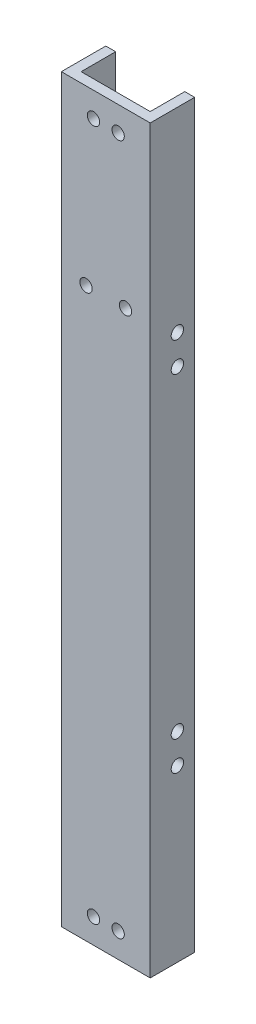
ISO-10303-21;
HEADER;
FILE_DESCRIPTION(('STEP AP214'),'2;1');
FILE_NAME('part.step','',(''),(''),'','','');
FILE_SCHEMA(('AUTOMOTIVE_DESIGN { 1 0 10303 214 1 1 1 1 }'));
ENDSEC;
DATA;
#1=APPLICATION_CONTEXT('core data for automotive mechanical design processes');
#2=APPLICATION_PROTOCOL_DEFINITION('international standard','automotive_design',2000,#1);
#3=PRODUCT_CONTEXT('',#1,'mechanical');
#4=PRODUCT('Part','Part','',(#3));
#5=PRODUCT_RELATED_PRODUCT_CATEGORY('part','',(#4));
#6=PRODUCT_DEFINITION_FORMATION('','',#4);
#7=PRODUCT_DEFINITION_CONTEXT('part definition',#1,'design');
#8=PRODUCT_DEFINITION('design','',#6,#7);
#9=PRODUCT_DEFINITION_SHAPE('','',#8);
#10=(LENGTH_UNIT() NAMED_UNIT(*) SI_UNIT(.MILLI.,.METRE.));
#11=(NAMED_UNIT(*) PLANE_ANGLE_UNIT() SI_UNIT($,.RADIAN.));
#12=(NAMED_UNIT(*) SI_UNIT($,.STERADIAN.) SOLID_ANGLE_UNIT());
#13=UNCERTAINTY_MEASURE_WITH_UNIT(LENGTH_MEASURE(1.E-05),#10,'distance_accuracy_value','');
#14=(GEOMETRIC_REPRESENTATION_CONTEXT(3) GLOBAL_UNCERTAINTY_ASSIGNED_CONTEXT((#13)) GLOBAL_UNIT_ASSIGNED_CONTEXT((#10,
#11,#12)) REPRESENTATION_CONTEXT('',''));
#15=CARTESIAN_POINT('',(0.,0.,0.));
#16=DIRECTION('',(0.,0.,1.));
#17=DIRECTION('',(1.,0.,0.));
#18=AXIS2_PLACEMENT_3D('',#15,#16,#17);
#19=CARTESIAN_POINT('',(9.,150.,-4.5));
#20=DIRECTION('',(-1.,0.,0.));
#21=DIRECTION('',(0.,0.,1.));
#22=AXIS2_PLACEMENT_3D('',#19,#20,#21);
#23=PLANE('',#22);
#24=CARTESIAN_POINT('',(9.,110.5,-0.999999999999985));
#25=DIRECTION('',(-1.,0.,0.));
#26=DIRECTION('',(0.,0.,1.));
#27=AXIS2_PLACEMENT_3D('',#24,#25,#26);
#28=CIRCLE('',#27,1.25);
#29=CARTESIAN_POINT('',(9.,110.5,0.250000000000016));
#30=VERTEX_POINT('',#29);
#31=EDGE_CURVE('E229',#30,#30,#28,.T.);
#32=ORIENTED_EDGE('',*,*,#31,.T.);
#33=EDGE_LOOP('',(#32));
#34=FACE_BOUND('',#33,.T.);
#35=CARTESIAN_POINT('',(9.,104.5,-0.999999999999984));
#36=DIRECTION('',(-1.,0.,0.));
#37=DIRECTION('',(0.,0.,1.));
#38=AXIS2_PLACEMENT_3D('',#35,#36,#37);
#39=CIRCLE('',#38,1.25);
#40=CARTESIAN_POINT('',(9.,104.5,0.250000000000016));
#41=VERTEX_POINT('',#40);
#42=EDGE_CURVE('E233',#41,#41,#39,.T.);
#43=ORIENTED_EDGE('',*,*,#42,.T.);
#44=EDGE_LOOP('',(#43));
#45=FACE_BOUND('',#44,.T.);
#46=CARTESIAN_POINT('',(9.,40.5,-0.99999999999998));
#47=DIRECTION('',(-1.,0.,0.));
#48=DIRECTION('',(0.,0.,1.));
#49=AXIS2_PLACEMENT_3D('',#46,#47,#48);
#50=CIRCLE('',#49,1.25);
#51=CARTESIAN_POINT('',(9.,40.5,0.250000000000021));
#52=VERTEX_POINT('',#51);
#53=EDGE_CURVE('E237',#52,#52,#50,.T.);
#54=ORIENTED_EDGE('',*,*,#53,.T.);
#55=EDGE_LOOP('',(#54));
#56=FACE_BOUND('',#55,.T.);
#57=CARTESIAN_POINT('',(9.,34.5,-0.99999999999998));
#58=DIRECTION('',(-1.,0.,0.));
#59=DIRECTION('',(0.,0.,1.));
#60=AXIS2_PLACEMENT_3D('',#57,#58,#59);
#61=CIRCLE('',#60,1.25);
#62=CARTESIAN_POINT('',(9.,34.5,0.25000000000002));
#63=VERTEX_POINT('',#62);
#64=EDGE_CURVE('E241',#63,#63,#61,.T.);
#65=ORIENTED_EDGE('',*,*,#64,.T.);
#66=EDGE_LOOP('',(#65));
#67=FACE_BOUND('',#66,.T.);
#68=DIRECTION('',(0.,0.,-1.));
#69=VECTOR('',#68,1.);
#70=CARTESIAN_POINT('',(9.,0.,-4.5));
#71=LINE('',#70,#69);
#72=CARTESIAN_POINT('',(9.,0.,4.5));
#73=VERTEX_POINT('',#72);
#74=CARTESIAN_POINT('',(9.,0.,-4.5));
#75=VERTEX_POINT('',#74);
#76=EDGE_CURVE('E141',#73,#75,#71,.T.);
#77=ORIENTED_EDGE('',*,*,#76,.T.);
#78=DIRECTION('',(0.,-1.,0.));
#79=VECTOR('',#78,1.);
#80=CARTESIAN_POINT('',(9.,150.,-4.5));
#81=LINE('',#80,#79);
#82=CARTESIAN_POINT('',(9.,150.,-4.5));
#83=VERTEX_POINT('',#82);
#84=EDGE_CURVE('E11',#83,#75,#81,.T.);
#85=ORIENTED_EDGE('',*,*,#84,.F.);
#86=DIRECTION('',(0.,0.,-1.));
#87=VECTOR('',#86,1.);
#88=CARTESIAN_POINT('',(9.,150.,-4.5));
#89=LINE('',#88,#87);
#90=CARTESIAN_POINT('',(9.,150.,4.5));
#91=VERTEX_POINT('',#90);
#92=EDGE_CURVE('E163',#91,#83,#89,.T.);
#93=ORIENTED_EDGE('',*,*,#92,.F.);
#94=DIRECTION('',(0.,-1.,0.));
#95=VECTOR('',#94,1.);
#96=CARTESIAN_POINT('',(9.,150.,4.5));
#97=LINE('',#96,#95);
#98=EDGE_CURVE('E137',#91,#73,#97,.T.);
#99=ORIENTED_EDGE('',*,*,#98,.T.);
#100=EDGE_LOOP('',(#77,#85,#93,#99));
#101=FACE_BOUND('',#100,.T.);
#102=ADVANCED_FACE('F38',(#34,#45,#56,#67,#101),#23,.F.);
#103=CARTESIAN_POINT('',(9.,150.,-4.5));
#104=DIRECTION('',(0.,0.,1.));
#105=DIRECTION('',(1.,0.,0.));
#106=AXIS2_PLACEMENT_3D('',#103,#104,#105);
#107=PLANE('',#106);
#108=DIRECTION('',(-1.,0.,0.));
#109=VECTOR('',#108,1.);
#110=CARTESIAN_POINT('',(9.,0.,-4.5));
#111=LINE('',#110,#109);
#112=CARTESIAN_POINT('',(7.,0.,-4.5));
#113=VERTEX_POINT('',#112);
#114=EDGE_CURVE('E145',#75,#113,#111,.T.);
#115=ORIENTED_EDGE('',*,*,#114,.T.);
#116=DIRECTION('',(0.,-1.,0.));
#117=VECTOR('',#116,1.);
#118=CARTESIAN_POINT('',(7.,150.,-4.5));
#119=LINE('',#118,#117);
#120=CARTESIAN_POINT('',(7.,150.,-4.5));
#121=VERTEX_POINT('',#120);
#122=EDGE_CURVE('E48',#121,#113,#119,.T.);
#123=ORIENTED_EDGE('',*,*,#122,.F.);
#124=DIRECTION('',(-1.,0.,0.));
#125=VECTOR('',#124,1.);
#126=CARTESIAN_POINT('',(9.,150.,-4.5));
#127=LINE('',#126,#125);
#128=EDGE_CURVE('E100',#83,#121,#127,.T.);
#129=ORIENTED_EDGE('',*,*,#128,.F.);
#130=ORIENTED_EDGE('',*,*,#84,.T.);
#131=EDGE_LOOP('',(#115,#123,#129,#130));
#132=FACE_BOUND('',#131,.T.);
#133=ADVANCED_FACE('F220',(#132),#107,.F.);
#134=CARTESIAN_POINT('',(7.,150.,-4.5));
#135=DIRECTION('',(1.,0.,0.));
#136=DIRECTION('',(0.,0.,-1.));
#137=AXIS2_PLACEMENT_3D('',#134,#135,#136);
#138=PLANE('',#137);
#139=CARTESIAN_POINT('',(7.,110.5,-0.999999999999985));
#140=DIRECTION('',(1.,0.,0.));
#141=DIRECTION('',(0.,0.,-1.));
#142=AXIS2_PLACEMENT_3D('',#139,#140,#141);
#143=CIRCLE('',#142,1.25);
#144=CARTESIAN_POINT('',(7.,110.5,-2.24999999999999));
#145=VERTEX_POINT('',#144);
#146=EDGE_CURVE('E281',#145,#145,#143,.T.);
#147=ORIENTED_EDGE('',*,*,#146,.T.);
#148=EDGE_LOOP('',(#147));
#149=FACE_BOUND('',#148,.T.);
#150=CARTESIAN_POINT('',(7.,104.5,-0.999999999999984));
#151=DIRECTION('',(1.,0.,0.));
#152=DIRECTION('',(0.,0.,-1.));
#153=AXIS2_PLACEMENT_3D('',#150,#151,#152);
#154=CIRCLE('',#153,1.25);
#155=CARTESIAN_POINT('',(7.,104.5,-2.24999999999998));
#156=VERTEX_POINT('',#155);
#157=EDGE_CURVE('E291',#156,#156,#154,.T.);
#158=ORIENTED_EDGE('',*,*,#157,.T.);
#159=EDGE_LOOP('',(#158));
#160=FACE_BOUND('',#159,.T.);
#161=CARTESIAN_POINT('',(7.,40.5,-0.99999999999998));
#162=DIRECTION('',(1.,0.,0.));
#163=DIRECTION('',(0.,0.,-1.));
#164=AXIS2_PLACEMENT_3D('',#161,#162,#163);
#165=CIRCLE('',#164,1.25);
#166=CARTESIAN_POINT('',(7.,40.5,-2.24999999999998));
#167=VERTEX_POINT('',#166);
#168=EDGE_CURVE('E301',#167,#167,#165,.T.);
#169=ORIENTED_EDGE('',*,*,#168,.T.);
#170=EDGE_LOOP('',(#169));
#171=FACE_BOUND('',#170,.T.);
#172=CARTESIAN_POINT('',(7.,34.5,-0.99999999999998));
#173=DIRECTION('',(1.,0.,0.));
#174=DIRECTION('',(0.,0.,-1.));
#175=AXIS2_PLACEMENT_3D('',#172,#173,#174);
#176=CIRCLE('',#175,1.25);
#177=CARTESIAN_POINT('',(7.,34.5,-2.24999999999998));
#178=VERTEX_POINT('',#177);
#179=EDGE_CURVE('E311',#178,#178,#176,.T.);
#180=ORIENTED_EDGE('',*,*,#179,.T.);
#181=EDGE_LOOP('',(#180));
#182=FACE_BOUND('',#181,.T.);
#183=DIRECTION('',(0.,0.,1.));
#184=VECTOR('',#183,1.);
#185=CARTESIAN_POINT('',(7.,0.,-4.5));
#186=LINE('',#185,#184);
#187=CARTESIAN_POINT('',(7.,0.,2.5));
#188=VERTEX_POINT('',#187);
#189=EDGE_CURVE('E148',#113,#188,#186,.T.);
#190=ORIENTED_EDGE('',*,*,#189,.T.);
#191=DIRECTION('',(0.,-1.,0.));
#192=VECTOR('',#191,1.);
#193=CARTESIAN_POINT('',(7.,150.,2.5));
#194=LINE('',#193,#192);
#195=CARTESIAN_POINT('',(7.,150.,2.5));
#196=VERTEX_POINT('',#195);
#197=EDGE_CURVE('E174',#196,#188,#194,.T.);
#198=ORIENTED_EDGE('',*,*,#197,.F.);
#199=DIRECTION('',(0.,0.,1.));
#200=VECTOR('',#199,1.);
#201=CARTESIAN_POINT('',(7.,150.,-4.5));
#202=LINE('',#201,#200);
#203=EDGE_CURVE('E252',#121,#196,#202,.T.);
#204=ORIENTED_EDGE('',*,*,#203,.F.);
#205=ORIENTED_EDGE('',*,*,#122,.T.);
#206=EDGE_LOOP('',(#190,#198,#204,#205));
#207=FACE_BOUND('',#206,.T.);
#208=ADVANCED_FACE('F225',(#149,#160,#171,#182,#207),#138,.F.);
#209=CARTESIAN_POINT('',(-7.,150.,2.5));
#210=DIRECTION('',(0.,0.,1.));
#211=DIRECTION('',(1.,0.,0.));
#212=AXIS2_PLACEMENT_3D('',#209,#210,#211);
#213=PLANE('',#212);
#214=CARTESIAN_POINT('',(-4.,115.,2.5));
#215=DIRECTION('',(0.,0.,1.));
#216=DIRECTION('',(1.,0.,0.));
#217=AXIS2_PLACEMENT_3D('',#214,#215,#216);
#218=CIRCLE('',#217,1.25);
#219=CARTESIAN_POINT('',(-2.75,115.,2.5));
#220=VERTEX_POINT('',#219);
#221=EDGE_CURVE('E325',#220,#220,#218,.F.);
#222=ORIENTED_EDGE('',*,*,#221,.F.);
#223=EDGE_LOOP('',(#222));
#224=FACE_BOUND('',#223,.T.);
#225=CARTESIAN_POINT('',(4.00000000000001,115.,2.5));
#226=DIRECTION('',(0.,0.,1.));
#227=DIRECTION('',(1.,0.,0.));
#228=AXIS2_PLACEMENT_3D('',#225,#226,#227);
#229=CIRCLE('',#228,1.25);
#230=CARTESIAN_POINT('',(5.25000000000001,115.,2.5));
#231=VERTEX_POINT('',#230);
#232=EDGE_CURVE('E336',#231,#231,#229,.F.);
#233=ORIENTED_EDGE('',*,*,#232,.F.);
#234=EDGE_LOOP('',(#233));
#235=FACE_BOUND('',#234,.T.);
#236=CARTESIAN_POINT('',(2.49999999999998,145.,2.5));
#237=DIRECTION('',(0.,0.,-1.));
#238=DIRECTION('',(1.,0.,0.));
#239=AXIS2_PLACEMENT_3D('',#236,#237,#238);
#240=CIRCLE('',#239,1.25);
#241=CARTESIAN_POINT('',(3.74999999999998,145.,2.5));
#242=VERTEX_POINT('',#241);
#243=EDGE_CURVE('E269',#242,#242,#240,.T.);
#244=ORIENTED_EDGE('',*,*,#243,.F.);
#245=EDGE_LOOP('',(#244));
#246=FACE_BOUND('',#245,.T.);
#247=CARTESIAN_POINT('',(-2.50000000000002,145.,2.5));
#248=DIRECTION('',(0.,0.,-1.));
#249=DIRECTION('',(1.,0.,0.));
#250=AXIS2_PLACEMENT_3D('',#247,#248,#249);
#251=CIRCLE('',#250,1.25);
#252=CARTESIAN_POINT('',(-1.25000000000002,145.,2.5));
#253=VERTEX_POINT('',#252);
#254=EDGE_CURVE('E272',#253,#253,#251,.T.);
#255=ORIENTED_EDGE('',*,*,#254,.F.);
#256=EDGE_LOOP('',(#255));
#257=FACE_BOUND('',#256,.T.);
#258=CARTESIAN_POINT('',(-2.50000000000002,5.,2.5));
#259=DIRECTION('',(0.,0.,-1.));
#260=DIRECTION('',(-1.,0.,0.));
#261=AXIS2_PLACEMENT_3D('',#258,#259,#260);
#262=CIRCLE('',#261,1.25);
#263=CARTESIAN_POINT('',(-3.75000000000002,5.,2.5));
#264=VERTEX_POINT('',#263);
#265=EDGE_CURVE('E268',#264,#264,#262,.T.);
#266=ORIENTED_EDGE('',*,*,#265,.F.);
#267=EDGE_LOOP('',(#266));
#268=FACE_BOUND('',#267,.T.);
#269=CARTESIAN_POINT('',(2.49999999999998,5.,2.5));
#270=DIRECTION('',(0.,0.,-1.));
#271=DIRECTION('',(-1.,0.,0.));
#272=AXIS2_PLACEMENT_3D('',#269,#270,#271);
#273=CIRCLE('',#272,1.25);
#274=CARTESIAN_POINT('',(1.24999999999998,5.,2.5));
#275=VERTEX_POINT('',#274);
#276=EDGE_CURVE('E186',#275,#275,#273,.T.);
#277=ORIENTED_EDGE('',*,*,#276,.F.);
#278=EDGE_LOOP('',(#277));
#279=FACE_BOUND('',#278,.T.);
#280=DIRECTION('',(-1.,0.,0.));
#281=VECTOR('',#280,1.);
#282=CARTESIAN_POINT('',(-7.,0.,2.5));
#283=LINE('',#282,#281);
#284=CARTESIAN_POINT('',(-7.,0.,2.5));
#285=VERTEX_POINT('',#284);
#286=EDGE_CURVE('E151',#188,#285,#283,.T.);
#287=ORIENTED_EDGE('',*,*,#286,.T.);
#288=DIRECTION('',(0.,-1.,0.));
#289=VECTOR('',#288,1.);
#290=CARTESIAN_POINT('',(-7.,150.,2.5));
#291=LINE('',#290,#289);
#292=CARTESIAN_POINT('',(-7.,150.,2.5));
#293=VERTEX_POINT('',#292);
#294=EDGE_CURVE('E170',#293,#285,#291,.T.);
#295=ORIENTED_EDGE('',*,*,#294,.F.);
#296=DIRECTION('',(-1.,0.,0.));
#297=VECTOR('',#296,1.);
#298=CARTESIAN_POINT('',(-7.,150.,2.5));
#299=LINE('',#298,#297);
#300=EDGE_CURVE('E255',#196,#293,#299,.T.);
#301=ORIENTED_EDGE('',*,*,#300,.F.);
#302=ORIENTED_EDGE('',*,*,#197,.T.);
#303=EDGE_LOOP('',(#287,#295,#301,#302));
#304=FACE_BOUND('',#303,.T.);
#305=ADVANCED_FACE('F400',(#224,#235,#246,#257,#268,#279,#304),#213,.F.);
#306=CARTESIAN_POINT('',(-7.,150.,-4.5));
#307=DIRECTION('',(-1.,0.,0.));
#308=DIRECTION('',(0.,0.,1.));
#309=AXIS2_PLACEMENT_3D('',#306,#307,#308);
#310=PLANE('',#309);
#311=CARTESIAN_POINT('',(-7.,110.5,-0.999999999999985));
#312=DIRECTION('',(-1.,0.,0.));
#313=DIRECTION('',(0.,0.,1.));
#314=AXIS2_PLACEMENT_3D('',#311,#312,#313);
#315=CIRCLE('',#314,1.25);
#316=CARTESIAN_POINT('',(-7.,110.5,0.250000000000016));
#317=VERTEX_POINT('',#316);
#318=EDGE_CURVE('E285',#317,#317,#315,.T.);
#319=ORIENTED_EDGE('',*,*,#318,.T.);
#320=EDGE_LOOP('',(#319));
#321=FACE_BOUND('',#320,.T.);
#322=CARTESIAN_POINT('',(-7.,104.5,-0.999999999999984));
#323=DIRECTION('',(-1.,0.,0.));
#324=DIRECTION('',(0.,0.,1.));
#325=AXIS2_PLACEMENT_3D('',#322,#323,#324);
#326=CIRCLE('',#325,1.25);
#327=CARTESIAN_POINT('',(-7.,104.5,0.250000000000016));
#328=VERTEX_POINT('',#327);
#329=EDGE_CURVE('E295',#328,#328,#326,.T.);
#330=ORIENTED_EDGE('',*,*,#329,.T.);
#331=EDGE_LOOP('',(#330));
#332=FACE_BOUND('',#331,.T.);
#333=CARTESIAN_POINT('',(-7.,40.5,-0.99999999999998));
#334=DIRECTION('',(-1.,0.,0.));
#335=DIRECTION('',(0.,0.,1.));
#336=AXIS2_PLACEMENT_3D('',#333,#334,#335);
#337=CIRCLE('',#336,1.25);
#338=CARTESIAN_POINT('',(-7.,40.5,0.250000000000021));
#339=VERTEX_POINT('',#338);
#340=EDGE_CURVE('E305',#339,#339,#337,.T.);
#341=ORIENTED_EDGE('',*,*,#340,.T.);
#342=EDGE_LOOP('',(#341));
#343=FACE_BOUND('',#342,.T.);
#344=CARTESIAN_POINT('',(-7.,34.5,-0.99999999999998));
#345=DIRECTION('',(-1.,0.,0.));
#346=DIRECTION('',(0.,0.,1.));
#347=AXIS2_PLACEMENT_3D('',#344,#345,#346);
#348=CIRCLE('',#347,1.25);
#349=CARTESIAN_POINT('',(-7.,34.5,0.25000000000002));
#350=VERTEX_POINT('',#349);
#351=EDGE_CURVE('E315',#350,#350,#348,.T.);
#352=ORIENTED_EDGE('',*,*,#351,.T.);
#353=EDGE_LOOP('',(#352));
#354=FACE_BOUND('',#353,.T.);
#355=DIRECTION('',(0.,0.,-1.));
#356=VECTOR('',#355,1.);
#357=CARTESIAN_POINT('',(-7.,0.,-4.5));
#358=LINE('',#357,#356);
#359=CARTESIAN_POINT('',(-7.,0.,-4.5));
#360=VERTEX_POINT('',#359);
#361=EDGE_CURVE('E154',#285,#360,#358,.T.);
#362=ORIENTED_EDGE('',*,*,#361,.T.);
#363=DIRECTION('',(0.,-1.,0.));
#364=VECTOR('',#363,1.);
#365=CARTESIAN_POINT('',(-7.,150.,-4.5));
#366=LINE('',#365,#364);
#367=CARTESIAN_POINT('',(-7.,150.,-4.5));
#368=VERTEX_POINT('',#367);
#369=EDGE_CURVE('E130',#368,#360,#366,.T.);
#370=ORIENTED_EDGE('',*,*,#369,.F.);
#371=DIRECTION('',(0.,0.,-1.));
#372=VECTOR('',#371,1.);
#373=CARTESIAN_POINT('',(-7.,150.,-4.5));
#374=LINE('',#373,#372);
#375=EDGE_CURVE('E119',#293,#368,#374,.T.);
#376=ORIENTED_EDGE('',*,*,#375,.F.);
#377=ORIENTED_EDGE('',*,*,#294,.T.);
#378=EDGE_LOOP('',(#362,#370,#376,#377));
#379=FACE_BOUND('',#378,.T.);
#380=ADVANCED_FACE('F403',(#321,#332,#343,#354,#379),#310,.F.);
#381=CARTESIAN_POINT('',(-9.,150.,-4.5));
#382=DIRECTION('',(0.,0.,1.));
#383=DIRECTION('',(1.,0.,0.));
#384=AXIS2_PLACEMENT_3D('',#381,#382,#383);
#385=PLANE('',#384);
#386=DIRECTION('',(-1.,0.,0.));
#387=VECTOR('',#386,1.);
#388=CARTESIAN_POINT('',(-9.,0.,-4.5));
#389=LINE('',#388,#387);
#390=CARTESIAN_POINT('',(-9.,0.,-4.5));
#391=VERTEX_POINT('',#390);
#392=EDGE_CURVE('E128',#360,#391,#389,.T.);
#393=ORIENTED_EDGE('',*,*,#392,.T.);
#394=DIRECTION('',(0.,-1.,0.));
#395=VECTOR('',#394,1.);
#396=CARTESIAN_POINT('',(-9.,150.,-4.5));
#397=LINE('',#396,#395);
#398=CARTESIAN_POINT('',(-9.,150.,-4.5));
#399=VERTEX_POINT('',#398);
#400=EDGE_CURVE('E125',#399,#391,#397,.T.);
#401=ORIENTED_EDGE('',*,*,#400,.F.);
#402=DIRECTION('',(-1.,0.,0.));
#403=VECTOR('',#402,1.);
#404=CARTESIAN_POINT('',(-9.,150.,-4.5));
#405=LINE('',#404,#403);
#406=EDGE_CURVE('E113',#368,#399,#405,.T.);
#407=ORIENTED_EDGE('',*,*,#406,.F.);
#408=ORIENTED_EDGE('',*,*,#369,.T.);
#409=EDGE_LOOP('',(#393,#401,#407,#408));
#410=FACE_BOUND('',#409,.T.);
#411=ADVANCED_FACE('F126',(#410),#385,.F.);
#412=CARTESIAN_POINT('',(-9.,150.,-4.5));
#413=DIRECTION('',(1.,0.,0.));
#414=DIRECTION('',(0.,0.,-1.));
#415=AXIS2_PLACEMENT_3D('',#412,#413,#414);
#416=PLANE('',#415);
#417=CARTESIAN_POINT('',(-9.,110.5,-0.999999999999985));
#418=DIRECTION('',(1.,0.,0.));
#419=DIRECTION('',(0.,0.,-1.));
#420=AXIS2_PLACEMENT_3D('',#417,#418,#419);
#421=CIRCLE('',#420,1.25);
#422=CARTESIAN_POINT('',(-9.,110.5,-2.24999999999999));
#423=VERTEX_POINT('',#422);
#424=EDGE_CURVE('E319',#423,#423,#421,.T.);
#425=ORIENTED_EDGE('',*,*,#424,.T.);
#426=EDGE_LOOP('',(#425));
#427=FACE_BOUND('',#426,.T.);
#428=CARTESIAN_POINT('',(-9.,104.5,-0.999999999999984));
#429=DIRECTION('',(1.,0.,0.));
#430=DIRECTION('',(0.,0.,-1.));
#431=AXIS2_PLACEMENT_3D('',#428,#429,#430);
#432=CIRCLE('',#431,1.25);
#433=CARTESIAN_POINT('',(-9.,104.5,-2.24999999999998));
#434=VERTEX_POINT('',#433);
#435=EDGE_CURVE('E329',#434,#434,#432,.T.);
#436=ORIENTED_EDGE('',*,*,#435,.T.);
#437=EDGE_LOOP('',(#436));
#438=FACE_BOUND('',#437,.T.);
#439=CARTESIAN_POINT('',(-9.,40.5,-0.99999999999998));
#440=DIRECTION('',(1.,0.,0.));
#441=DIRECTION('',(0.,0.,-1.));
#442=AXIS2_PLACEMENT_3D('',#439,#440,#441);
#443=CIRCLE('',#442,1.25);
#444=CARTESIAN_POINT('',(-9.,40.5,-2.24999999999998));
#445=VERTEX_POINT('',#444);
#446=EDGE_CURVE('E324',#445,#445,#443,.T.);
#447=ORIENTED_EDGE('',*,*,#446,.T.);
#448=EDGE_LOOP('',(#447));
#449=FACE_BOUND('',#448,.T.);
#450=CARTESIAN_POINT('',(-9.,34.5,-0.99999999999998));
#451=DIRECTION('',(1.,0.,0.));
#452=DIRECTION('',(0.,0.,-1.));
#453=AXIS2_PLACEMENT_3D('',#450,#451,#452);
#454=CIRCLE('',#453,1.25);
#455=CARTESIAN_POINT('',(-9.,34.5,-2.24999999999998));
#456=VERTEX_POINT('',#455);
#457=EDGE_CURVE('E320',#456,#456,#454,.T.);
#458=ORIENTED_EDGE('',*,*,#457,.T.);
#459=EDGE_LOOP('',(#458));
#460=FACE_BOUND('',#459,.T.);
#461=DIRECTION('',(0.,0.,1.));
#462=VECTOR('',#461,1.);
#463=CARTESIAN_POINT('',(-9.,0.,-4.5));
#464=LINE('',#463,#462);
#465=CARTESIAN_POINT('',(-9.,0.,4.5));
#466=VERTEX_POINT('',#465);
#467=EDGE_CURVE('E86',#391,#466,#464,.T.);
#468=ORIENTED_EDGE('',*,*,#467,.T.);
#469=DIRECTION('',(0.,-1.,0.));
#470=VECTOR('',#469,1.);
#471=CARTESIAN_POINT('',(-9.,150.,4.5));
#472=LINE('',#471,#470);
#473=CARTESIAN_POINT('',(-9.,150.,4.5));
#474=VERTEX_POINT('',#473);
#475=EDGE_CURVE('E131',#474,#466,#472,.T.);
#476=ORIENTED_EDGE('',*,*,#475,.F.);
#477=DIRECTION('',(0.,0.,1.));
#478=VECTOR('',#477,1.);
#479=CARTESIAN_POINT('',(-9.,150.,-4.5));
#480=LINE('',#479,#478);
#481=EDGE_CURVE('E117',#399,#474,#480,.T.);
#482=ORIENTED_EDGE('',*,*,#481,.F.);
#483=ORIENTED_EDGE('',*,*,#400,.T.);
#484=EDGE_LOOP('',(#468,#476,#482,#483));
#485=FACE_BOUND('',#484,.T.);
#486=ADVANCED_FACE('F133',(#427,#438,#449,#460,#485),#416,.F.);
#487=CARTESIAN_POINT('',(-9.,150.,4.5));
#488=DIRECTION('',(0.,0.,-1.));
#489=DIRECTION('',(-1.,0.,0.));
#490=AXIS2_PLACEMENT_3D('',#487,#488,#489);
#491=PLANE('',#490);
#492=CARTESIAN_POINT('',(-4.,115.,4.5));
#493=DIRECTION('',(0.,0.,1.));
#494=DIRECTION('',(1.,0.,0.));
#495=AXIS2_PLACEMENT_3D('',#492,#493,#494);
#496=CIRCLE('',#495,1.25);
#497=CARTESIAN_POINT('',(-2.75,115.,4.5));
#498=VERTEX_POINT('',#497);
#499=EDGE_CURVE('E340',#498,#498,#496,.T.);
#500=ORIENTED_EDGE('',*,*,#499,.F.);
#501=EDGE_LOOP('',(#500));
#502=FACE_BOUND('',#501,.T.);
#503=CARTESIAN_POINT('',(4.00000000000001,115.,4.5));
#504=DIRECTION('',(0.,0.,1.));
#505=DIRECTION('',(-1.,0.,0.));
#506=AXIS2_PLACEMENT_3D('',#503,#504,#505);
#507=CIRCLE('',#506,1.25);
#508=CARTESIAN_POINT('',(2.75000000000001,115.,4.5));
#509=VERTEX_POINT('',#508);
#510=EDGE_CURVE('E341',#509,#509,#507,.T.);
#511=ORIENTED_EDGE('',*,*,#510,.F.);
#512=EDGE_LOOP('',(#511));
#513=FACE_BOUND('',#512,.T.);
#514=CARTESIAN_POINT('',(2.49999999999998,145.,4.5));
#515=DIRECTION('',(0.,0.,-1.));
#516=DIRECTION('',(-1.,0.,0.));
#517=AXIS2_PLACEMENT_3D('',#514,#515,#516);
#518=CIRCLE('',#517,1.25);
#519=CARTESIAN_POINT('',(1.24999999999998,145.,4.5));
#520=VERTEX_POINT('',#519);
#521=EDGE_CURVE('E41',#520,#520,#518,.T.);
#522=ORIENTED_EDGE('',*,*,#521,.T.);
#523=EDGE_LOOP('',(#522));
#524=FACE_BOUND('',#523,.T.);
#525=CARTESIAN_POINT('',(-2.50000000000002,145.,4.5));
#526=DIRECTION('',(0.,0.,-1.));
#527=DIRECTION('',(-1.,0.,0.));
#528=AXIS2_PLACEMENT_3D('',#525,#526,#527);
#529=CIRCLE('',#528,1.25);
#530=CARTESIAN_POINT('',(-3.75000000000002,145.,4.5));
#531=VERTEX_POINT('',#530);
#532=EDGE_CURVE('E189',#531,#531,#529,.T.);
#533=ORIENTED_EDGE('',*,*,#532,.T.);
#534=EDGE_LOOP('',(#533));
#535=FACE_BOUND('',#534,.T.);
#536=CARTESIAN_POINT('',(-2.50000000000002,5.,4.5));
#537=DIRECTION('',(0.,0.,-1.));
#538=DIRECTION('',(-1.,0.,0.));
#539=AXIS2_PLACEMENT_3D('',#536,#537,#538);
#540=CIRCLE('',#539,1.25);
#541=CARTESIAN_POINT('',(-3.75000000000002,5.,4.5));
#542=VERTEX_POINT('',#541);
#543=EDGE_CURVE('E185',#542,#542,#540,.T.);
#544=ORIENTED_EDGE('',*,*,#543,.T.);
#545=EDGE_LOOP('',(#544));
#546=FACE_BOUND('',#545,.T.);
#547=CARTESIAN_POINT('',(2.49999999999998,5.,4.5));
#548=DIRECTION('',(0.,0.,-1.));
#549=DIRECTION('',(-1.,0.,0.));
#550=AXIS2_PLACEMENT_3D('',#547,#548,#549);
#551=CIRCLE('',#550,1.25);
#552=CARTESIAN_POINT('',(1.24999999999998,5.,4.5));
#553=VERTEX_POINT('',#552);
#554=EDGE_CURVE('E181',#553,#553,#551,.T.);
#555=ORIENTED_EDGE('',*,*,#554,.T.);
#556=EDGE_LOOP('',(#555));
#557=FACE_BOUND('',#556,.T.);
#558=DIRECTION('',(1.,0.,0.));
#559=VECTOR('',#558,1.);
#560=CARTESIAN_POINT('',(-9.,0.,4.5));
#561=LINE('',#560,#559);
#562=EDGE_CURVE('E92',#466,#73,#561,.T.);
#563=ORIENTED_EDGE('',*,*,#562,.T.);
#564=ORIENTED_EDGE('',*,*,#98,.F.);
#565=DIRECTION('',(1.,0.,0.));
#566=VECTOR('',#565,1.);
#567=CARTESIAN_POINT('',(-9.,150.,4.5));
#568=LINE('',#567,#566);
#569=EDGE_CURVE('E57',#474,#91,#568,.T.);
#570=ORIENTED_EDGE('',*,*,#569,.F.);
#571=ORIENTED_EDGE('',*,*,#475,.T.);
#572=EDGE_LOOP('',(#563,#564,#570,#571));
#573=FACE_BOUND('',#572,.T.);
#574=ADVANCED_FACE('F198',(#502,#513,#524,#535,#546,#557,#573),#491,.F.);
#575=CARTESIAN_POINT('',(0.,150.,0.));
#576=DIRECTION('',(0.,1.,0.));
#577=DIRECTION('',(0.,0.,1.));
#578=AXIS2_PLACEMENT_3D('',#575,#576,#577);
#579=PLANE('',#578);
#580=ORIENTED_EDGE('',*,*,#92,.T.);
#581=ORIENTED_EDGE('',*,*,#128,.T.);
#582=ORIENTED_EDGE('',*,*,#203,.T.);
#583=ORIENTED_EDGE('',*,*,#300,.T.);
#584=ORIENTED_EDGE('',*,*,#375,.T.);
#585=ORIENTED_EDGE('',*,*,#406,.T.);
#586=ORIENTED_EDGE('',*,*,#481,.T.);
#587=ORIENTED_EDGE('',*,*,#569,.T.);
#588=EDGE_LOOP('',(#580,#581,#582,#583,#584,#585,#586,#587));
#589=FACE_BOUND('',#588,.T.);
#590=ADVANCED_FACE('F115',(#589),#579,.T.);
#591=CARTESIAN_POINT('',(0.,0.,0.));
#592=DIRECTION('',(0.,1.,0.));
#593=DIRECTION('',(0.,0.,1.));
#594=AXIS2_PLACEMENT_3D('',#591,#592,#593);
#595=PLANE('',#594);
#596=ORIENTED_EDGE('',*,*,#76,.F.);
#597=ORIENTED_EDGE('',*,*,#562,.F.);
#598=ORIENTED_EDGE('',*,*,#467,.F.);
#599=ORIENTED_EDGE('',*,*,#392,.F.);
#600=ORIENTED_EDGE('',*,*,#361,.F.);
#601=ORIENTED_EDGE('',*,*,#286,.F.);
#602=ORIENTED_EDGE('',*,*,#189,.F.);
#603=ORIENTED_EDGE('',*,*,#114,.F.);
#604=EDGE_LOOP('',(#596,#597,#598,#599,#600,#601,#602,#603));
#605=FACE_BOUND('',#604,.T.);
#606=ADVANCED_FACE('F246',(#605),#595,.F.);
#607=CARTESIAN_POINT('',(2.49999999999998,5.,12.5));
#608=DIRECTION('',(0.,0.,-1.));
#609=DIRECTION('',(-1.,0.,0.));
#610=AXIS2_PLACEMENT_3D('',#607,#608,#609);
#611=CYLINDRICAL_SURFACE('',#610,1.25);
#612=ORIENTED_EDGE('',*,*,#276,.T.);
#613=EDGE_LOOP('',(#612));
#614=FACE_BOUND('',#613,.T.);
#615=ORIENTED_EDGE('',*,*,#554,.F.);
#616=EDGE_LOOP('',(#615));
#617=FACE_BOUND('',#616,.T.);
#618=ADVANCED_FACE('F386',(#614,#617),#611,.F.);
#619=CARTESIAN_POINT('',(-2.50000000000002,5.,12.5));
#620=DIRECTION('',(0.,0.,-1.));
#621=DIRECTION('',(-1.,0.,0.));
#622=AXIS2_PLACEMENT_3D('',#619,#620,#621);
#623=CYLINDRICAL_SURFACE('',#622,1.25);
#624=ORIENTED_EDGE('',*,*,#265,.T.);
#625=EDGE_LOOP('',(#624));
#626=FACE_BOUND('',#625,.T.);
#627=ORIENTED_EDGE('',*,*,#543,.F.);
#628=EDGE_LOOP('',(#627));
#629=FACE_BOUND('',#628,.T.);
#630=ADVANCED_FACE('F214',(#626,#629),#623,.F.);
#631=CARTESIAN_POINT('',(-2.50000000000002,145.,12.5));
#632=DIRECTION('',(0.,0.,-1.));
#633=DIRECTION('',(-1.,0.,0.));
#634=AXIS2_PLACEMENT_3D('',#631,#632,#633);
#635=CYLINDRICAL_SURFACE('',#634,1.25);
#636=ORIENTED_EDGE('',*,*,#254,.T.);
#637=EDGE_LOOP('',(#636));
#638=FACE_BOUND('',#637,.T.);
#639=ORIENTED_EDGE('',*,*,#532,.F.);
#640=EDGE_LOOP('',(#639));
#641=FACE_BOUND('',#640,.T.);
#642=ADVANCED_FACE('F203',(#638,#641),#635,.F.);
#643=CARTESIAN_POINT('',(2.49999999999998,145.,12.5));
#644=DIRECTION('',(0.,0.,-1.));
#645=DIRECTION('',(-1.,0.,0.));
#646=AXIS2_PLACEMENT_3D('',#643,#644,#645);
#647=CYLINDRICAL_SURFACE('',#646,1.25);
#648=ORIENTED_EDGE('',*,*,#243,.T.);
#649=EDGE_LOOP('',(#648));
#650=FACE_BOUND('',#649,.T.);
#651=ORIENTED_EDGE('',*,*,#521,.F.);
#652=EDGE_LOOP('',(#651));
#653=FACE_BOUND('',#652,.T.);
#654=ADVANCED_FACE('F200',(#650,#653),#647,.F.);
#655=CARTESIAN_POINT('',(-9.,34.5,-0.99999999999998));
#656=DIRECTION('',(1.,0.,0.));
#657=DIRECTION('',(0.,0.,-1.));
#658=AXIS2_PLACEMENT_3D('',#655,#656,#657);
#659=CYLINDRICAL_SURFACE('',#658,1.25);
#660=ORIENTED_EDGE('',*,*,#457,.F.);
#661=EDGE_LOOP('',(#660));
#662=FACE_BOUND('',#661,.T.);
#663=ORIENTED_EDGE('',*,*,#351,.F.);
#664=EDGE_LOOP('',(#663));
#665=FACE_BOUND('',#664,.T.);
#666=ADVANCED_FACE('F202',(#662,#665),#659,.F.);
#667=CARTESIAN_POINT('',(-9.,40.5,-0.99999999999998));
#668=DIRECTION('',(1.,0.,0.));
#669=DIRECTION('',(0.,0.,-1.));
#670=AXIS2_PLACEMENT_3D('',#667,#668,#669);
#671=CYLINDRICAL_SURFACE('',#670,1.25);
#672=ORIENTED_EDGE('',*,*,#446,.F.);
#673=EDGE_LOOP('',(#672));
#674=FACE_BOUND('',#673,.T.);
#675=ORIENTED_EDGE('',*,*,#340,.F.);
#676=EDGE_LOOP('',(#675));
#677=FACE_BOUND('',#676,.T.);
#678=ADVANCED_FACE('F210',(#674,#677),#671,.F.);
#679=CARTESIAN_POINT('',(-9.,104.5,-0.999999999999984));
#680=DIRECTION('',(1.,0.,0.));
#681=DIRECTION('',(0.,0.,-1.));
#682=AXIS2_PLACEMENT_3D('',#679,#680,#681);
#683=CYLINDRICAL_SURFACE('',#682,1.25);
#684=ORIENTED_EDGE('',*,*,#435,.F.);
#685=EDGE_LOOP('',(#684));
#686=FACE_BOUND('',#685,.T.);
#687=ORIENTED_EDGE('',*,*,#329,.F.);
#688=EDGE_LOOP('',(#687));
#689=FACE_BOUND('',#688,.T.);
#690=ADVANCED_FACE('F379',(#686,#689),#683,.F.);
#691=CARTESIAN_POINT('',(-9.,110.5,-0.999999999999985));
#692=DIRECTION('',(1.,0.,0.));
#693=DIRECTION('',(0.,0.,-1.));
#694=AXIS2_PLACEMENT_3D('',#691,#692,#693);
#695=CYLINDRICAL_SURFACE('',#694,1.25);
#696=ORIENTED_EDGE('',*,*,#424,.F.);
#697=EDGE_LOOP('',(#696));
#698=FACE_BOUND('',#697,.T.);
#699=ORIENTED_EDGE('',*,*,#318,.F.);
#700=EDGE_LOOP('',(#699));
#701=FACE_BOUND('',#700,.T.);
#702=ADVANCED_FACE('F373',(#698,#701),#695,.F.);
#703=ORIENTED_EDGE('',*,*,#179,.F.);
#704=EDGE_LOOP('',(#703));
#705=FACE_BOUND('',#704,.T.);
#706=ORIENTED_EDGE('',*,*,#64,.F.);
#707=EDGE_LOOP('',(#706));
#708=FACE_BOUND('',#707,.T.);
#709=ADVANCED_FACE('F213',(#705,#708),#659,.F.);
#710=ORIENTED_EDGE('',*,*,#168,.F.);
#711=EDGE_LOOP('',(#710));
#712=FACE_BOUND('',#711,.T.);
#713=ORIENTED_EDGE('',*,*,#53,.F.);
#714=EDGE_LOOP('',(#713));
#715=FACE_BOUND('',#714,.T.);
#716=ADVANCED_FACE('F377',(#712,#715),#671,.F.);
#717=ORIENTED_EDGE('',*,*,#157,.F.);
#718=EDGE_LOOP('',(#717));
#719=FACE_BOUND('',#718,.T.);
#720=ORIENTED_EDGE('',*,*,#42,.F.);
#721=EDGE_LOOP('',(#720));
#722=FACE_BOUND('',#721,.T.);
#723=ADVANCED_FACE('F370',(#719,#722),#683,.F.);
#724=ORIENTED_EDGE('',*,*,#146,.F.);
#725=EDGE_LOOP('',(#724));
#726=FACE_BOUND('',#725,.T.);
#727=ORIENTED_EDGE('',*,*,#31,.F.);
#728=EDGE_LOOP('',(#727));
#729=FACE_BOUND('',#728,.T.);
#730=ADVANCED_FACE('F361',(#726,#729),#695,.F.);
#731=CARTESIAN_POINT('',(4.00000000000001,115.,-1.03553390593274));
#732=DIRECTION('',(0.,0.,1.));
#733=DIRECTION('',(1.,0.,0.));
#734=AXIS2_PLACEMENT_3D('',#731,#732,#733);
#735=CYLINDRICAL_SURFACE('',#734,1.25);
#736=ORIENTED_EDGE('',*,*,#232,.T.);
#737=EDGE_LOOP('',(#736));
#738=FACE_BOUND('',#737,.T.);
#739=ORIENTED_EDGE('',*,*,#510,.T.);
#740=EDGE_LOOP('',(#739));
#741=FACE_BOUND('',#740,.T.);
#742=ADVANCED_FACE('F359',(#738,#741),#735,.F.);
#743=CARTESIAN_POINT('',(-4.,115.,-1.03553390593274));
#744=DIRECTION('',(0.,0.,1.));
#745=DIRECTION('',(1.,0.,0.));
#746=AXIS2_PLACEMENT_3D('',#743,#744,#745);
#747=CYLINDRICAL_SURFACE('',#746,1.25);
#748=ORIENTED_EDGE('',*,*,#221,.T.);
#749=EDGE_LOOP('',(#748));
#750=FACE_BOUND('',#749,.T.);
#751=ORIENTED_EDGE('',*,*,#499,.T.);
#752=EDGE_LOOP('',(#751));
#753=FACE_BOUND('',#752,.T.);
#754=ADVANCED_FACE('F352',(#750,#753),#747,.F.);
#755=CLOSED_SHELL('',(#102,#133,#208,#305,#380,#411,#486,#574,#590,#606,#618,#630,#642,#654,
#666,#678,#690,#702,#709,#716,#723,#730,#742,#754));
#756=MANIFOLD_SOLID_BREP('B2',#755);
#757=ADVANCED_BREP_SHAPE_REPRESENTATION('',(#18,#756),#14);
#758=SHAPE_DEFINITION_REPRESENTATION(#9,#757);
ENDSEC;
END-ISO-10303-21;
